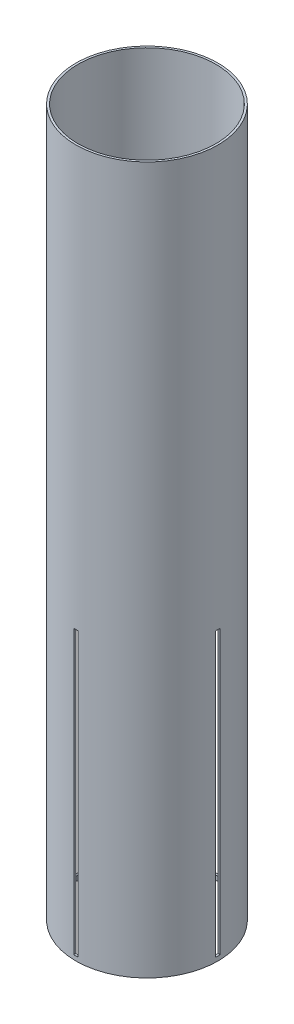
ISO-10303-21;
HEADER;
FILE_DESCRIPTION(('STEP AP214'),'2;1');
FILE_NAME('part.step','',(''),(''),'','','');
FILE_SCHEMA(('AUTOMOTIVE_DESIGN { 1 0 10303 214 1 1 1 1 }'));
ENDSEC;
DATA;
#1=APPLICATION_CONTEXT('core data for automotive mechanical design processes');
#2=APPLICATION_PROTOCOL_DEFINITION('international standard','automotive_design',2000,#1);
#3=PRODUCT_CONTEXT('',#1,'mechanical');
#4=PRODUCT('Part','Part','',(#3));
#5=PRODUCT_RELATED_PRODUCT_CATEGORY('part','',(#4));
#6=PRODUCT_DEFINITION_FORMATION('','',#4);
#7=PRODUCT_DEFINITION_CONTEXT('part definition',#1,'design');
#8=PRODUCT_DEFINITION('design','',#6,#7);
#9=PRODUCT_DEFINITION_SHAPE('','',#8);
#10=(LENGTH_UNIT() NAMED_UNIT(*) SI_UNIT(.MILLI.,.METRE.));
#11=(NAMED_UNIT(*) PLANE_ANGLE_UNIT() SI_UNIT($,.RADIAN.));
#12=(NAMED_UNIT(*) SI_UNIT($,.STERADIAN.) SOLID_ANGLE_UNIT());
#13=UNCERTAINTY_MEASURE_WITH_UNIT(LENGTH_MEASURE(1.E-05),#10,'distance_accuracy_value','');
#14=(GEOMETRIC_REPRESENTATION_CONTEXT(3) GLOBAL_UNCERTAINTY_ASSIGNED_CONTEXT((#13)) GLOBAL_UNIT_ASSIGNED_CONTEXT((#10,
#11,#12)) REPRESENTATION_CONTEXT('',''));
#15=CARTESIAN_POINT('',(0.,0.,0.));
#16=DIRECTION('',(0.,0.,1.));
#17=DIRECTION('',(1.,0.,0.));
#18=AXIS2_PLACEMENT_3D('',#15,#16,#17);
#19=CARTESIAN_POINT('',(0.,508.,0.));
#20=DIRECTION('',(0.,1.,0.));
#21=DIRECTION('',(0.,0.,1.));
#22=AXIS2_PLACEMENT_3D('',#19,#20,#21);
#23=PLANE('',#22);
#24=CARTESIAN_POINT('',(0.,508.,0.));
#25=DIRECTION('',(0.,1.,0.));
#26=DIRECTION('',(0.,0.,1.));
#27=AXIS2_PLACEMENT_3D('',#24,#25,#26);
#28=CIRCLE('',#27,51.054);
#29=CARTESIAN_POINT('',(0.,508.,51.054));
#30=VERTEX_POINT('',#29);
#31=EDGE_CURVE('E321',#30,#30,#28,.T.);
#32=ORIENTED_EDGE('',*,*,#31,.T.);
#33=EDGE_LOOP('',(#32));
#34=FACE_BOUND('',#33,.T.);
#35=CARTESIAN_POINT('',(0.,508.,0.));
#36=DIRECTION('',(0.,1.,0.));
#37=DIRECTION('',(0.,0.,1.));
#38=AXIS2_PLACEMENT_3D('',#35,#36,#37);
#39=CIRCLE('',#38,49.53);
#40=CARTESIAN_POINT('',(0.,508.,49.53));
#41=VERTEX_POINT('',#40);
#42=EDGE_CURVE('E313',#41,#41,#39,.T.);
#43=ORIENTED_EDGE('',*,*,#42,.F.);
#44=EDGE_LOOP('',(#43));
#45=FACE_BOUND('',#44,.T.);
#46=ADVANCED_FACE('F44',(#34,#45),#23,.T.);
#47=CARTESIAN_POINT('',(0.,0.,0.));
#48=DIRECTION('',(0.,1.,0.));
#49=DIRECTION('',(0.,0.,1.));
#50=AXIS2_PLACEMENT_3D('',#47,#48,#49);
#51=PLANE('',#50);
#52=CARTESIAN_POINT('',(0.,0.,0.));
#53=DIRECTION('',(0.,1.,0.));
#54=DIRECTION('',(0.,0.,1.));
#55=AXIS2_PLACEMENT_3D('',#52,#53,#54);
#56=CIRCLE('',#55,51.054);
#57=CARTESIAN_POINT('',(0.,0.,51.054));
#58=VERTEX_POINT('',#57);
#59=EDGE_CURVE('E317',#58,#58,#56,.T.);
#60=ORIENTED_EDGE('',*,*,#59,.F.);
#61=EDGE_LOOP('',(#60));
#62=FACE_BOUND('',#61,.T.);
#63=CARTESIAN_POINT('',(0.,0.,0.));
#64=DIRECTION('',(0.,1.,0.));
#65=DIRECTION('',(0.,0.,1.));
#66=AXIS2_PLACEMENT_3D('',#63,#64,#65);
#67=CIRCLE('',#66,49.53);
#68=CARTESIAN_POINT('',(0.,0.,49.53));
#69=VERTEX_POINT('',#68);
#70=EDGE_CURVE('E312',#69,#69,#67,.T.);
#71=ORIENTED_EDGE('',*,*,#70,.T.);
#72=EDGE_LOOP('',(#71));
#73=FACE_BOUND('',#72,.T.);
#74=ADVANCED_FACE('F370',(#62,#73),#51,.F.);
#75=CARTESIAN_POINT('',(0.,508.,0.));
#76=DIRECTION('',(0.,-1.,0.));
#77=DIRECTION('',(0.,0.,-1.));
#78=AXIS2_PLACEMENT_3D('',#75,#76,#77);
#79=CYLINDRICAL_SURFACE('',#78,51.054);
#80=DIRECTION('',(0.,-1.,0.));
#81=VECTOR('',#80,1.);
#82=CARTESIAN_POINT('',(51.0293127501243,508.,-1.58749999999988));
#83=LINE('',#82,#81);
#84=CARTESIAN_POINT('',(51.0293127501243,206.375,-1.58749999999985));
#85=VERTEX_POINT('',#84);
#86=CARTESIAN_POINT('',(51.0293127501243,3.17500000000004,-1.58749999999982));
#87=VERTEX_POINT('',#86);
#88=EDGE_CURVE('E234',#85,#87,#83,.T.);
#89=ORIENTED_EDGE('',*,*,#88,.T.);
#90=CARTESIAN_POINT('',(0.,3.17500000000004,0.));
#91=DIRECTION('',(0.,-1.,0.));
#92=DIRECTION('',(0.,0.,-1.));
#93=AXIS2_PLACEMENT_3D('',#90,#91,#92);
#94=CIRCLE('',#93,51.054);
#95=CARTESIAN_POINT('',(51.0293127501243,3.17500000000004,1.58750000000018));
#96=VERTEX_POINT('',#95);
#97=EDGE_CURVE('E60',#87,#96,#94,.T.);
#98=ORIENTED_EDGE('',*,*,#97,.T.);
#99=DIRECTION('',(0.,-1.,0.));
#100=VECTOR('',#99,1.);
#101=CARTESIAN_POINT('',(51.0293127501243,508.,1.58750000000024));
#102=LINE('',#101,#100);
#103=CARTESIAN_POINT('',(51.0293127501243,206.375,1.5875000000002));
#104=VERTEX_POINT('',#103);
#105=EDGE_CURVE('E246',#96,#104,#102,.F.);
#106=ORIENTED_EDGE('',*,*,#105,.T.);
#107=CARTESIAN_POINT('',(0.,206.375,0.));
#108=DIRECTION('',(0.,1.,0.));
#109=DIRECTION('',(0.,0.,1.));
#110=AXIS2_PLACEMENT_3D('',#107,#108,#109);
#111=CIRCLE('',#110,51.054);
#112=EDGE_CURVE('E276',#104,#85,#111,.T.);
#113=ORIENTED_EDGE('',*,*,#112,.T.);
#114=EDGE_LOOP('',(#89,#98,#106,#113));
#115=FACE_BOUND('',#114,.T.);
#116=CARTESIAN_POINT('',(-1.58750000000003,206.375,51.0293127501243));
#117=VERTEX_POINT('',#116);
#118=CARTESIAN_POINT('',(1.58750000000003,206.375,51.0293127501243));
#119=VERTEX_POINT('',#118);
#120=EDGE_CURVE('E272',#117,#119,#111,.T.);
#121=ORIENTED_EDGE('',*,*,#120,.T.);
#122=DIRECTION('',(0.,-1.,0.));
#123=VECTOR('',#122,1.);
#124=CARTESIAN_POINT('',(1.58750000000006,508.,51.0293127501243));
#125=LINE('',#124,#123);
#126=CARTESIAN_POINT('',(1.5875,3.175,51.0293127501243));
#127=VERTEX_POINT('',#126);
#128=EDGE_CURVE('E263',#119,#127,#125,.T.);
#129=ORIENTED_EDGE('',*,*,#128,.T.);
#130=CARTESIAN_POINT('',(-1.5875,3.175,51.0293127501243));
#131=VERTEX_POINT('',#130);
#132=EDGE_CURVE('E269',#127,#131,#94,.T.);
#133=ORIENTED_EDGE('',*,*,#132,.T.);
#134=DIRECTION('',(0.,-1.,0.));
#135=VECTOR('',#134,1.);
#136=CARTESIAN_POINT('',(-1.58750000000006,508.,51.0293127501243));
#137=LINE('',#136,#135);
#138=EDGE_CURVE('E259',#131,#117,#137,.F.);
#139=ORIENTED_EDGE('',*,*,#138,.T.);
#140=EDGE_LOOP('',(#121,#129,#133,#139));
#141=FACE_BOUND('',#140,.T.);
#142=DIRECTION('',(0.,-1.,0.));
#143=VECTOR('',#142,1.);
#144=CARTESIAN_POINT('',(-51.0293127501243,508.,-1.58750000000024));
#145=LINE('',#144,#143);
#146=CARTESIAN_POINT('',(-51.0293127501243,3.17500000000004,-1.58750000000018));
#147=VERTEX_POINT('',#146);
#148=CARTESIAN_POINT('',(-51.0293127501243,206.375,-1.5875000000002));
#149=VERTEX_POINT('',#148);
#150=EDGE_CURVE('E277',#147,#149,#145,.F.);
#151=ORIENTED_EDGE('',*,*,#150,.T.);
#152=CARTESIAN_POINT('',(-51.0293127501243,206.375,1.58749999999949));
#153=VERTEX_POINT('',#152);
#154=EDGE_CURVE('E275',#149,#153,#111,.T.);
#155=ORIENTED_EDGE('',*,*,#154,.T.);
#156=DIRECTION('',(0.,-1.,0.));
#157=VECTOR('',#156,1.);
#158=CARTESIAN_POINT('',(-51.0293127501243,508.,1.58749999999953));
#159=LINE('',#158,#157);
#160=CARTESIAN_POINT('',(-51.0293127501243,3.17500000000004,1.58749999999953));
#161=VERTEX_POINT('',#160);
#162=EDGE_CURVE('E236',#153,#161,#159,.T.);
#163=ORIENTED_EDGE('',*,*,#162,.T.);
#164=EDGE_CURVE('E179',#161,#147,#94,.T.);
#165=ORIENTED_EDGE('',*,*,#164,.T.);
#166=EDGE_LOOP('',(#151,#155,#163,#165));
#167=FACE_BOUND('',#166,.T.);
#168=DIRECTION('',(0.,-1.,0.));
#169=VECTOR('',#168,1.);
#170=CARTESIAN_POINT('',(1.58750000000006,508.,-51.0293127501243));
#171=LINE('',#170,#169);
#172=CARTESIAN_POINT('',(1.5875,3.17500000000004,-51.0293127501243));
#173=VERTEX_POINT('',#172);
#174=CARTESIAN_POINT('',(1.58750000000003,206.375,-51.0293127501243));
#175=VERTEX_POINT('',#174);
#176=EDGE_CURVE('E301',#173,#175,#171,.F.);
#177=ORIENTED_EDGE('',*,*,#176,.T.);
#178=CARTESIAN_POINT('',(0.,206.375,0.));
#179=DIRECTION('',(0.,1.,0.));
#180=DIRECTION('',(0.,0.,1.));
#181=AXIS2_PLACEMENT_3D('',#178,#179,#180);
#182=CIRCLE('',#181,51.054);
#183=CARTESIAN_POINT('',(-1.58750000000003,206.375,-51.0293127501243));
#184=VERTEX_POINT('',#183);
#185=EDGE_CURVE('E305',#175,#184,#182,.T.);
#186=ORIENTED_EDGE('',*,*,#185,.T.);
#187=DIRECTION('',(0.,-1.,0.));
#188=VECTOR('',#187,1.);
#189=CARTESIAN_POINT('',(-1.58750000000006,508.,-51.0293127501243));
#190=LINE('',#189,#188);
#191=CARTESIAN_POINT('',(-1.5875,3.17500000000004,-51.0293127501243));
#192=VERTEX_POINT('',#191);
#193=EDGE_CURVE('E308',#184,#192,#190,.T.);
#194=ORIENTED_EDGE('',*,*,#193,.T.);
#195=CARTESIAN_POINT('',(0.,3.17500000000004,0.));
#196=DIRECTION('',(0.,-1.,0.));
#197=DIRECTION('',(0.,0.,-1.));
#198=AXIS2_PLACEMENT_3D('',#195,#196,#197);
#199=CIRCLE('',#198,51.054);
#200=EDGE_CURVE('E288',#192,#173,#199,.T.);
#201=ORIENTED_EDGE('',*,*,#200,.T.);
#202=EDGE_LOOP('',(#177,#186,#194,#201));
#203=FACE_BOUND('',#202,.T.);
#204=ORIENTED_EDGE('',*,*,#31,.F.);
#205=EDGE_LOOP('',(#204));
#206=FACE_BOUND('',#205,.T.);
#207=ORIENTED_EDGE('',*,*,#59,.T.);
#208=EDGE_LOOP('',(#207));
#209=FACE_BOUND('',#208,.T.);
#210=ADVANCED_FACE('F46',(#115,#141,#167,#203,#206,#209),#79,.T.);
#211=CARTESIAN_POINT('',(0.,508.,0.));
#212=DIRECTION('',(0.,-1.,0.));
#213=DIRECTION('',(0.,0.,-1.));
#214=AXIS2_PLACEMENT_3D('',#211,#212,#213);
#215=CYLINDRICAL_SURFACE('',#214,49.53);
#216=DIRECTION('',(0.,-1.,0.));
#217=VECTOR('',#216,1.);
#218=CARTESIAN_POINT('',(49.504552757802,508.,-1.58749999999989));
#219=LINE('',#218,#217);
#220=CARTESIAN_POINT('',(49.504552757802,206.375,-1.58749999999985));
#221=VERTEX_POINT('',#220);
#222=CARTESIAN_POINT('',(49.504552757802,3.17500000000004,-1.58749999999983));
#223=VERTEX_POINT('',#222);
#224=EDGE_CURVE('E11',#221,#223,#219,.T.);
#225=ORIENTED_EDGE('',*,*,#224,.F.);
#226=CARTESIAN_POINT('',(0.,206.375,0.));
#227=DIRECTION('',(0.,1.,0.));
#228=DIRECTION('',(0.,0.,1.));
#229=AXIS2_PLACEMENT_3D('',#226,#227,#228);
#230=CIRCLE('',#229,49.53);
#231=CARTESIAN_POINT('',(49.504552757802,206.375,1.5875000000002));
#232=VERTEX_POINT('',#231);
#233=EDGE_CURVE('E53',#232,#221,#230,.T.);
#234=ORIENTED_EDGE('',*,*,#233,.F.);
#235=DIRECTION('',(0.,-1.,0.));
#236=VECTOR('',#235,1.);
#237=CARTESIAN_POINT('',(49.504552757802,508.,1.58750000000023));
#238=LINE('',#237,#236);
#239=CARTESIAN_POINT('',(49.504552757802,3.17500000000004,1.58750000000017));
#240=VERTEX_POINT('',#239);
#241=EDGE_CURVE('E196',#240,#232,#238,.F.);
#242=ORIENTED_EDGE('',*,*,#241,.F.);
#243=CARTESIAN_POINT('',(0.,3.17500000000004,0.));
#244=DIRECTION('',(0.,-1.,0.));
#245=DIRECTION('',(0.,0.,-1.));
#246=AXIS2_PLACEMENT_3D('',#243,#244,#245);
#247=CIRCLE('',#246,49.53);
#248=EDGE_CURVE('E190',#223,#240,#247,.T.);
#249=ORIENTED_EDGE('',*,*,#248,.F.);
#250=EDGE_LOOP('',(#225,#234,#242,#249));
#251=FACE_BOUND('',#250,.T.);
#252=DIRECTION('',(0.,-1.,0.));
#253=VECTOR('',#252,1.);
#254=CARTESIAN_POINT('',(1.58750000000006,508.,49.504552757802));
#255=LINE('',#254,#253);
#256=CARTESIAN_POINT('',(1.58750000000003,206.375,49.504552757802));
#257=VERTEX_POINT('',#256);
#258=CARTESIAN_POINT('',(1.5875,3.175,49.504552757802));
#259=VERTEX_POINT('',#258);
#260=EDGE_CURVE('E197',#257,#259,#255,.T.);
#261=ORIENTED_EDGE('',*,*,#260,.F.);
#262=CARTESIAN_POINT('',(-1.58750000000003,206.375,49.504552757802));
#263=VERTEX_POINT('',#262);
#264=EDGE_CURVE('E194',#263,#257,#230,.T.);
#265=ORIENTED_EDGE('',*,*,#264,.F.);
#266=DIRECTION('',(0.,-1.,0.));
#267=VECTOR('',#266,1.);
#268=CARTESIAN_POINT('',(-1.58750000000006,508.,49.504552757802));
#269=LINE('',#268,#267);
#270=CARTESIAN_POINT('',(-1.58750000000006,3.17500000000004,49.504552757802));
#271=VERTEX_POINT('',#270);
#272=EDGE_CURVE('E200',#271,#263,#269,.F.);
#273=ORIENTED_EDGE('',*,*,#272,.F.);
#274=EDGE_CURVE('E191',#259,#271,#247,.T.);
#275=ORIENTED_EDGE('',*,*,#274,.F.);
#276=EDGE_LOOP('',(#261,#265,#273,#275));
#277=FACE_BOUND('',#276,.T.);
#278=DIRECTION('',(0.,-1.,0.));
#279=VECTOR('',#278,1.);
#280=CARTESIAN_POINT('',(-49.504552757802,508.,-1.58750000000023));
#281=LINE('',#280,#279);
#282=CARTESIAN_POINT('',(-49.504552757802,3.17500000000004,-1.58750000000017));
#283=VERTEX_POINT('',#282);
#284=CARTESIAN_POINT('',(-49.504552757802,206.375,-1.5875000000002));
#285=VERTEX_POINT('',#284);
#286=EDGE_CURVE('E186',#283,#285,#281,.F.);
#287=ORIENTED_EDGE('',*,*,#286,.F.);
#288=CARTESIAN_POINT('',(-49.504552757802,3.175,1.58749999999948));
#289=VERTEX_POINT('',#288);
#290=EDGE_CURVE('E172',#289,#283,#247,.T.);
#291=ORIENTED_EDGE('',*,*,#290,.F.);
#292=DIRECTION('',(0.,-1.,0.));
#293=VECTOR('',#292,1.);
#294=CARTESIAN_POINT('',(-49.504552757802,508.,1.58749999999954));
#295=LINE('',#294,#293);
#296=CARTESIAN_POINT('',(-49.504552757802,206.375,1.58749999999954));
#297=VERTEX_POINT('',#296);
#298=EDGE_CURVE('E159',#297,#289,#295,.T.);
#299=ORIENTED_EDGE('',*,*,#298,.F.);
#300=EDGE_CURVE('E188',#285,#297,#230,.T.);
#301=ORIENTED_EDGE('',*,*,#300,.F.);
#302=EDGE_LOOP('',(#287,#291,#299,#301));
#303=FACE_BOUND('',#302,.T.);
#304=DIRECTION('',(0.,-1.,0.));
#305=VECTOR('',#304,1.);
#306=CARTESIAN_POINT('',(-1.58750000000006,508.,-49.504552757802));
#307=LINE('',#306,#305);
#308=CARTESIAN_POINT('',(-1.58750000000003,206.375,-49.504552757802));
#309=VERTEX_POINT('',#308);
#310=CARTESIAN_POINT('',(-1.5875,3.17500000000004,-49.504552757802));
#311=VERTEX_POINT('',#310);
#312=EDGE_CURVE('E173',#309,#311,#307,.T.);
#313=ORIENTED_EDGE('',*,*,#312,.F.);
#314=CARTESIAN_POINT('',(0.,206.375,0.));
#315=DIRECTION('',(0.,1.,0.));
#316=DIRECTION('',(0.,0.,1.));
#317=AXIS2_PLACEMENT_3D('',#314,#315,#316);
#318=CIRCLE('',#317,49.53);
#319=CARTESIAN_POINT('',(1.58750000000003,206.375,-49.504552757802));
#320=VERTEX_POINT('',#319);
#321=EDGE_CURVE('E334',#320,#309,#318,.T.);
#322=ORIENTED_EDGE('',*,*,#321,.F.);
#323=DIRECTION('',(0.,-1.,0.));
#324=VECTOR('',#323,1.);
#325=CARTESIAN_POINT('',(1.58750000000006,508.,-49.504552757802));
#326=LINE('',#325,#324);
#327=CARTESIAN_POINT('',(1.5875,3.17500000000004,-49.504552757802));
#328=VERTEX_POINT('',#327);
#329=EDGE_CURVE('E331',#328,#320,#326,.F.);
#330=ORIENTED_EDGE('',*,*,#329,.F.);
#331=CARTESIAN_POINT('',(0.,3.17500000000004,0.));
#332=DIRECTION('',(0.,-1.,0.));
#333=DIRECTION('',(0.,0.,-1.));
#334=AXIS2_PLACEMENT_3D('',#331,#332,#333);
#335=CIRCLE('',#334,49.53);
#336=EDGE_CURVE('E325',#311,#328,#335,.T.);
#337=ORIENTED_EDGE('',*,*,#336,.F.);
#338=EDGE_LOOP('',(#313,#322,#330,#337));
#339=FACE_BOUND('',#338,.T.);
#340=ORIENTED_EDGE('',*,*,#42,.T.);
#341=EDGE_LOOP('',(#340));
#342=FACE_BOUND('',#341,.T.);
#343=ORIENTED_EDGE('',*,*,#70,.F.);
#344=EDGE_LOOP('',(#343));
#345=FACE_BOUND('',#344,.T.);
#346=ADVANCED_FACE('F184',(#251,#277,#303,#339,#342,#345),#215,.F.);
#347=CARTESIAN_POINT('',(-1.58750000000003,206.375,-51.054));
#348=DIRECTION('',(-1.,0.,0.));
#349=DIRECTION('',(0.,-1.,0.));
#350=AXIS2_PLACEMENT_3D('',#347,#348,#349);
#351=PLANE('',#350);
#352=DIRECTION('',(0.,0.,1.));
#353=VECTOR('',#352,1.);
#354=CARTESIAN_POINT('',(-1.58750000000003,206.375,-51.054));
#355=LINE('',#354,#353);
#356=EDGE_CURVE('E284',#184,#309,#355,.T.);
#357=ORIENTED_EDGE('',*,*,#356,.T.);
#358=ORIENTED_EDGE('',*,*,#312,.T.);
#359=DIRECTION('',(0.,0.,1.));
#360=VECTOR('',#359,1.);
#361=CARTESIAN_POINT('',(-1.5875,3.175,-51.054));
#362=LINE('',#361,#360);
#363=EDGE_CURVE('E283',#192,#311,#362,.T.);
#364=ORIENTED_EDGE('',*,*,#363,.F.);
#365=ORIENTED_EDGE('',*,*,#193,.F.);
#366=EDGE_LOOP('',(#357,#358,#364,#365));
#367=FACE_BOUND('',#366,.T.);
#368=ADVANCED_FACE('F343',(#367),#351,.F.);
#369=CARTESIAN_POINT('',(-1.58750000000003,206.375,-51.054));
#370=DIRECTION('',(0.,1.,0.));
#371=DIRECTION('',(0.,0.,1.));
#372=AXIS2_PLACEMENT_3D('',#369,#370,#371);
#373=PLANE('',#372);
#374=DIRECTION('',(0.,0.,1.));
#375=VECTOR('',#374,1.);
#376=CARTESIAN_POINT('',(1.58750000000003,206.375,-51.054));
#377=LINE('',#376,#375);
#378=EDGE_CURVE('E289',#175,#320,#377,.T.);
#379=ORIENTED_EDGE('',*,*,#378,.T.);
#380=ORIENTED_EDGE('',*,*,#321,.T.);
#381=ORIENTED_EDGE('',*,*,#356,.F.);
#382=ORIENTED_EDGE('',*,*,#185,.F.);
#383=EDGE_LOOP('',(#379,#380,#381,#382));
#384=FACE_BOUND('',#383,.T.);
#385=ADVANCED_FACE('F359',(#384),#373,.F.);
#386=CARTESIAN_POINT('',(1.58750000000003,206.375,-51.054));
#387=DIRECTION('',(1.,0.,0.));
#388=DIRECTION('',(0.,1.,0.));
#389=AXIS2_PLACEMENT_3D('',#386,#387,#388);
#390=PLANE('',#389);
#391=DIRECTION('',(0.,0.,1.));
#392=VECTOR('',#391,1.);
#393=CARTESIAN_POINT('',(1.5875,3.175,-51.054));
#394=LINE('',#393,#392);
#395=EDGE_CURVE('E293',#173,#328,#394,.T.);
#396=ORIENTED_EDGE('',*,*,#395,.T.);
#397=ORIENTED_EDGE('',*,*,#329,.T.);
#398=ORIENTED_EDGE('',*,*,#378,.F.);
#399=ORIENTED_EDGE('',*,*,#176,.F.);
#400=EDGE_LOOP('',(#396,#397,#398,#399));
#401=FACE_BOUND('',#400,.T.);
#402=ADVANCED_FACE('F354',(#401),#390,.F.);
#403=CARTESIAN_POINT('',(-1.5875,3.175,-51.054));
#404=DIRECTION('',(0.,-1.,0.));
#405=DIRECTION('',(0.,0.,-1.));
#406=AXIS2_PLACEMENT_3D('',#403,#404,#405);
#407=PLANE('',#406);
#408=ORIENTED_EDGE('',*,*,#200,.F.);
#409=ORIENTED_EDGE('',*,*,#363,.T.);
#410=ORIENTED_EDGE('',*,*,#336,.T.);
#411=ORIENTED_EDGE('',*,*,#395,.F.);
#412=EDGE_LOOP('',(#408,#409,#410,#411));
#413=FACE_BOUND('',#412,.T.);
#414=ADVANCED_FACE('F351',(#413),#407,.F.);
#415=CARTESIAN_POINT('',(-51.0540000000005,206.375,1.58749999999949));
#416=DIRECTION('',(0.,0.,1.));
#417=DIRECTION('',(1.,0.,0.));
#418=AXIS2_PLACEMENT_3D('',#415,#416,#417);
#419=PLANE('',#418);
#420=DIRECTION('',(1.,0.,0.));
#421=VECTOR('',#420,1.);
#422=CARTESIAN_POINT('',(-51.0540000000005,206.375,1.58749999999949));
#423=LINE('',#422,#421);
#424=EDGE_CURVE('E166',#153,#297,#423,.T.);
#425=ORIENTED_EDGE('',*,*,#424,.T.);
#426=ORIENTED_EDGE('',*,*,#298,.T.);
#427=DIRECTION('',(1.,0.,0.));
#428=VECTOR('',#427,1.);
#429=CARTESIAN_POINT('',(-51.0540000000005,3.175,1.58749999999947));
#430=LINE('',#429,#428);
#431=EDGE_CURVE('E163',#161,#289,#430,.T.);
#432=ORIENTED_EDGE('',*,*,#431,.F.);
#433=ORIENTED_EDGE('',*,*,#162,.F.);
#434=EDGE_LOOP('',(#425,#426,#432,#433));
#435=FACE_BOUND('',#434,.T.);
#436=ADVANCED_FACE('F161',(#435),#419,.F.);
#437=CARTESIAN_POINT('',(51.0540000000002,3.175,-1.58749999999982));
#438=DIRECTION('',(0.,-1.,0.));
#439=DIRECTION('',(0.,0.,-1.));
#440=AXIS2_PLACEMENT_3D('',#437,#438,#439);
#441=PLANE('',#440);
#442=ORIENTED_EDGE('',*,*,#431,.T.);
#443=ORIENTED_EDGE('',*,*,#290,.T.);
#444=DIRECTION('',(-1.,0.,0.));
#445=VECTOR('',#444,1.);
#446=CARTESIAN_POINT('',(51.0540000000002,3.175,-1.58749999999982));
#447=LINE('',#446,#445);
#448=EDGE_CURVE('E252',#283,#147,#447,.T.);
#449=ORIENTED_EDGE('',*,*,#448,.T.);
#450=ORIENTED_EDGE('',*,*,#164,.F.);
#451=EDGE_LOOP('',(#442,#443,#449,#450));
#452=FACE_BOUND('',#451,.T.);
#453=ADVANCED_FACE('F176',(#452),#441,.F.);
#454=CARTESIAN_POINT('',(51.0540000000002,206.375,-1.58749999999985));
#455=DIRECTION('',(0.,1.,0.));
#456=DIRECTION('',(0.,0.,1.));
#457=AXIS2_PLACEMENT_3D('',#454,#455,#456);
#458=PLANE('',#457);
#459=DIRECTION('',(-1.,0.,0.));
#460=VECTOR('',#459,1.);
#461=CARTESIAN_POINT('',(51.0540000000002,206.375,-1.58749999999985));
#462=LINE('',#461,#460);
#463=EDGE_CURVE('E237',#285,#149,#462,.T.);
#464=ORIENTED_EDGE('',*,*,#463,.F.);
#465=ORIENTED_EDGE('',*,*,#300,.T.);
#466=ORIENTED_EDGE('',*,*,#424,.F.);
#467=ORIENTED_EDGE('',*,*,#154,.F.);
#468=EDGE_LOOP('',(#464,#465,#466,#467));
#469=FACE_BOUND('',#468,.T.);
#470=ADVANCED_FACE('F390',(#469),#458,.F.);
#471=CARTESIAN_POINT('',(51.0540000000002,206.375,-1.58749999999985));
#472=DIRECTION('',(0.,0.,-1.));
#473=DIRECTION('',(-1.,0.,0.));
#474=AXIS2_PLACEMENT_3D('',#471,#472,#473);
#475=PLANE('',#474);
#476=ORIENTED_EDGE('',*,*,#448,.F.);
#477=ORIENTED_EDGE('',*,*,#286,.T.);
#478=ORIENTED_EDGE('',*,*,#463,.T.);
#479=ORIENTED_EDGE('',*,*,#150,.F.);
#480=EDGE_LOOP('',(#476,#477,#478,#479));
#481=FACE_BOUND('',#480,.T.);
#482=ADVANCED_FACE('F398',(#481),#475,.F.);
#483=CARTESIAN_POINT('',(-1.58750000000003,206.375,51.054));
#484=DIRECTION('',(-1.,0.,0.));
#485=DIRECTION('',(0.,-1.,0.));
#486=AXIS2_PLACEMENT_3D('',#483,#484,#485);
#487=PLANE('',#486);
#488=DIRECTION('',(0.,0.,-1.));
#489=VECTOR('',#488,1.);
#490=CARTESIAN_POINT('',(-1.5875,3.175,51.054));
#491=LINE('',#490,#489);
#492=EDGE_CURVE('E427',#131,#271,#491,.T.);
#493=ORIENTED_EDGE('',*,*,#492,.T.);
#494=ORIENTED_EDGE('',*,*,#272,.T.);
#495=DIRECTION('',(0.,0.,-1.));
#496=VECTOR('',#495,1.);
#497=CARTESIAN_POINT('',(-1.58750000000003,206.375,51.054));
#498=LINE('',#497,#496);
#499=EDGE_CURVE('E68',#117,#263,#498,.T.);
#500=ORIENTED_EDGE('',*,*,#499,.F.);
#501=ORIENTED_EDGE('',*,*,#138,.F.);
#502=EDGE_LOOP('',(#493,#494,#500,#501));
#503=FACE_BOUND('',#502,.T.);
#504=ADVANCED_FACE('F394',(#503),#487,.F.);
#505=CARTESIAN_POINT('',(1.58750000000003,206.375,51.054));
#506=DIRECTION('',(1.,0.,0.));
#507=DIRECTION('',(0.,1.,0.));
#508=AXIS2_PLACEMENT_3D('',#505,#506,#507);
#509=PLANE('',#508);
#510=DIRECTION('',(0.,0.,-1.));
#511=VECTOR('',#510,1.);
#512=CARTESIAN_POINT('',(1.58750000000003,206.375,51.054));
#513=LINE('',#512,#511);
#514=EDGE_CURVE('E256',#119,#257,#513,.T.);
#515=ORIENTED_EDGE('',*,*,#514,.T.);
#516=ORIENTED_EDGE('',*,*,#260,.T.);
#517=DIRECTION('',(0.,0.,-1.));
#518=VECTOR('',#517,1.);
#519=CARTESIAN_POINT('',(1.5875,3.175,51.054));
#520=LINE('',#519,#518);
#521=EDGE_CURVE('E429',#127,#259,#520,.T.);
#522=ORIENTED_EDGE('',*,*,#521,.F.);
#523=ORIENTED_EDGE('',*,*,#128,.F.);
#524=EDGE_LOOP('',(#515,#516,#522,#523));
#525=FACE_BOUND('',#524,.T.);
#526=ADVANCED_FACE('F397',(#525),#509,.F.);
#527=ORIENTED_EDGE('',*,*,#521,.T.);
#528=ORIENTED_EDGE('',*,*,#274,.T.);
#529=ORIENTED_EDGE('',*,*,#492,.F.);
#530=ORIENTED_EDGE('',*,*,#132,.F.);
#531=EDGE_LOOP('',(#527,#528,#529,#530));
#532=FACE_BOUND('',#531,.T.);
#533=ADVANCED_FACE('F392',(#532),#441,.F.);
#534=ORIENTED_EDGE('',*,*,#120,.F.);
#535=ORIENTED_EDGE('',*,*,#499,.T.);
#536=ORIENTED_EDGE('',*,*,#264,.T.);
#537=ORIENTED_EDGE('',*,*,#514,.F.);
#538=EDGE_LOOP('',(#534,#535,#536,#537));
#539=FACE_BOUND('',#538,.T.);
#540=ADVANCED_FACE('F404',(#539),#458,.F.);
#541=EDGE_CURVE('E225',#85,#221,#462,.T.);
#542=ORIENTED_EDGE('',*,*,#541,.T.);
#543=ORIENTED_EDGE('',*,*,#224,.T.);
#544=EDGE_CURVE('E244',#87,#223,#447,.T.);
#545=ORIENTED_EDGE('',*,*,#544,.F.);
#546=ORIENTED_EDGE('',*,*,#88,.F.);
#547=EDGE_LOOP('',(#542,#543,#545,#546));
#548=FACE_BOUND('',#547,.T.);
#549=ADVANCED_FACE('F231',(#548),#475,.F.);
#550=DIRECTION('',(-1.,0.,0.));
#551=VECTOR('',#550,1.);
#552=CARTESIAN_POINT('',(51.0540000000002,206.375,1.5875000000002));
#553=LINE('',#552,#551);
#554=EDGE_CURVE('E226',#104,#232,#553,.T.);
#555=ORIENTED_EDGE('',*,*,#554,.T.);
#556=ORIENTED_EDGE('',*,*,#233,.T.);
#557=ORIENTED_EDGE('',*,*,#541,.F.);
#558=ORIENTED_EDGE('',*,*,#112,.F.);
#559=EDGE_LOOP('',(#555,#556,#557,#558));
#560=FACE_BOUND('',#559,.T.);
#561=ADVANCED_FACE('F224',(#560),#458,.F.);
#562=CARTESIAN_POINT('',(51.0540000000002,206.375,1.5875000000002));
#563=DIRECTION('',(0.,0.,1.));
#564=DIRECTION('',(1.,0.,0.));
#565=AXIS2_PLACEMENT_3D('',#562,#563,#564);
#566=PLANE('',#565);
#567=DIRECTION('',(-1.,0.,0.));
#568=VECTOR('',#567,1.);
#569=CARTESIAN_POINT('',(51.0540000000002,3.175,1.58750000000018));
#570=LINE('',#569,#568);
#571=EDGE_CURVE('E242',#96,#240,#570,.T.);
#572=ORIENTED_EDGE('',*,*,#571,.T.);
#573=ORIENTED_EDGE('',*,*,#241,.T.);
#574=ORIENTED_EDGE('',*,*,#554,.F.);
#575=ORIENTED_EDGE('',*,*,#105,.F.);
#576=EDGE_LOOP('',(#572,#573,#574,#575));
#577=FACE_BOUND('',#576,.T.);
#578=ADVANCED_FACE('F245',(#577),#566,.F.);
#579=ORIENTED_EDGE('',*,*,#544,.T.);
#580=ORIENTED_EDGE('',*,*,#248,.T.);
#581=ORIENTED_EDGE('',*,*,#571,.F.);
#582=ORIENTED_EDGE('',*,*,#97,.F.);
#583=EDGE_LOOP('',(#579,#580,#581,#582));
#584=FACE_BOUND('',#583,.T.);
#585=ADVANCED_FACE('F241',(#584),#441,.F.);
#586=CLOSED_SHELL('',(#46,#74,#210,#346,#368,#385,#402,#414,#436,#453,#470,#482,#504,#526,#533,
#540,#549,#561,#578,#585));
#587=MANIFOLD_SOLID_BREP('B2',#586);
#588=ADVANCED_BREP_SHAPE_REPRESENTATION('',(#18,#587),#14);
#589=SHAPE_DEFINITION_REPRESENTATION(#9,#588);
ENDSEC;
END-ISO-10303-21;
